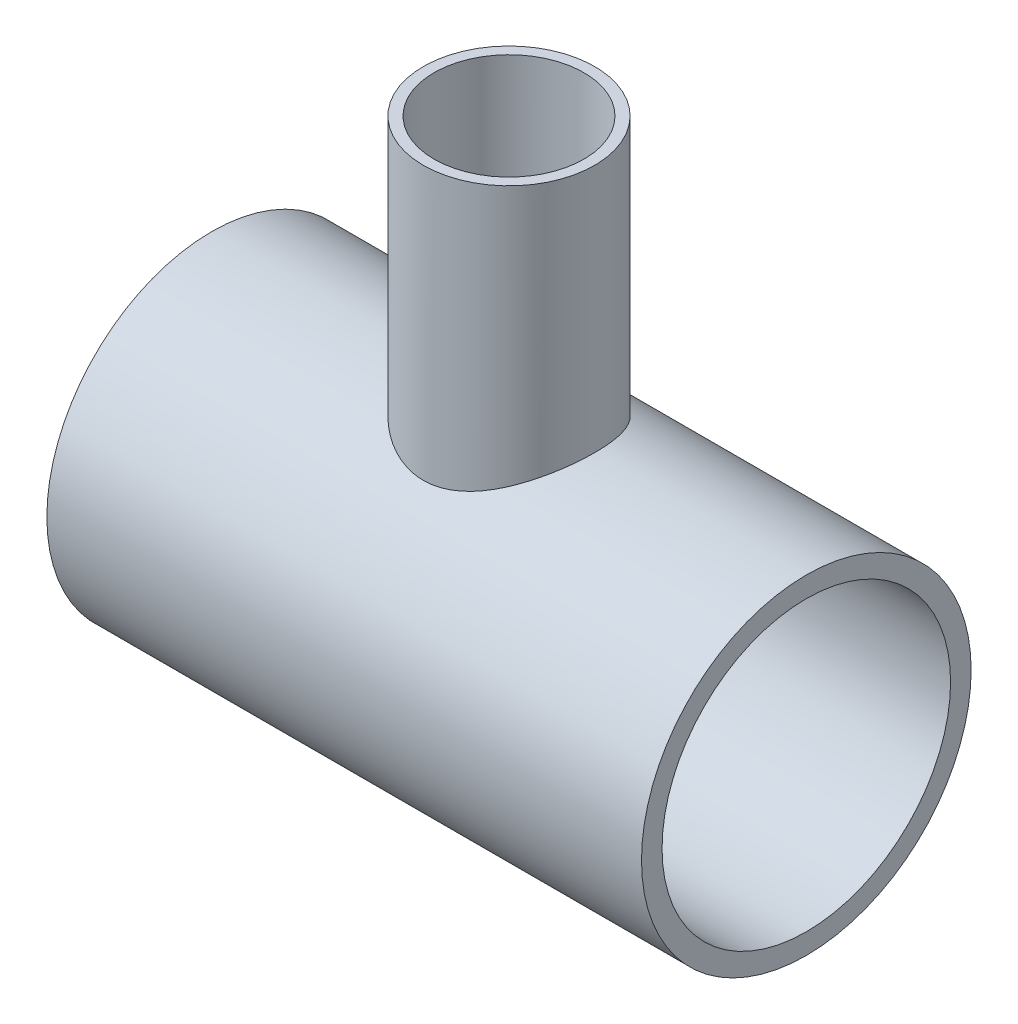
ISO-10303-21;
HEADER;
FILE_DESCRIPTION(('STEP AP214'),'2;1');
FILE_NAME('part.step','',(''),(''),'','','');
FILE_SCHEMA(('AUTOMOTIVE_DESIGN { 1 0 10303 214 1 1 1 1 }'));
ENDSEC;
DATA;
#1=APPLICATION_CONTEXT('core data for automotive mechanical design processes');
#2=APPLICATION_PROTOCOL_DEFINITION('international standard','automotive_design',2000,#1);
#3=PRODUCT_CONTEXT('',#1,'mechanical');
#4=PRODUCT('Part','Part','',(#3));
#5=PRODUCT_RELATED_PRODUCT_CATEGORY('part','',(#4));
#6=PRODUCT_DEFINITION_FORMATION('','',#4);
#7=PRODUCT_DEFINITION_CONTEXT('part definition',#1,'design');
#8=PRODUCT_DEFINITION('design','',#6,#7);
#9=PRODUCT_DEFINITION_SHAPE('','',#8);
#10=(LENGTH_UNIT() NAMED_UNIT(*) SI_UNIT(.MILLI.,.METRE.));
#11=(NAMED_UNIT(*) PLANE_ANGLE_UNIT() SI_UNIT($,.RADIAN.));
#12=(NAMED_UNIT(*) SI_UNIT($,.STERADIAN.) SOLID_ANGLE_UNIT());
#13=UNCERTAINTY_MEASURE_WITH_UNIT(LENGTH_MEASURE(1.E-05),#10,'distance_accuracy_value','');
#14=(GEOMETRIC_REPRESENTATION_CONTEXT(3) GLOBAL_UNCERTAINTY_ASSIGNED_CONTEXT((#13)) GLOBAL_UNIT_ASSIGNED_CONTEXT((#10,
#11,#12)) REPRESENTATION_CONTEXT('',''));
#15=CARTESIAN_POINT('',(0.,0.,0.));
#16=DIRECTION('',(0.,0.,1.));
#17=DIRECTION('',(1.,0.,0.));
#18=AXIS2_PLACEMENT_3D('',#15,#16,#17);
#19=CARTESIAN_POINT('',(-292.1,161.925,0.));
#20=DIRECTION('',(1.,0.,0.));
#21=DIRECTION('',(0.,0.,-1.));
#22=AXIS2_PLACEMENT_3D('',#19,#20,#21);
#23=PLANE('',#22);
#24=CARTESIAN_POINT('',(-292.1,0.,0.));
#25=DIRECTION('',(-1.,0.,0.));
#26=DIRECTION('',(0.,0.,1.));
#27=AXIS2_PLACEMENT_3D('',#24,#25,#26);
#28=CIRCLE('',#27,141.732);
#29=CARTESIAN_POINT('',(-292.1,0.,141.732));
#30=VERTEX_POINT('',#29);
#31=EDGE_CURVE('E10',#30,#30,#28,.T.);
#32=ORIENTED_EDGE('',*,*,#31,.F.);
#33=EDGE_LOOP('',(#32));
#34=FACE_BOUND('',#33,.T.);
#35=CARTESIAN_POINT('',(-292.1,0.,0.));
#36=DIRECTION('',(-1.,0.,0.));
#37=DIRECTION('',(0.,0.,1.));
#38=AXIS2_PLACEMENT_3D('',#35,#36,#37);
#39=CIRCLE('',#38,161.925);
#40=CARTESIAN_POINT('',(-292.1,0.,161.925));
#41=VERTEX_POINT('',#40);
#42=EDGE_CURVE('E52',#41,#41,#39,.T.);
#43=ORIENTED_EDGE('',*,*,#42,.T.);
#44=EDGE_LOOP('',(#43));
#45=FACE_BOUND('',#44,.T.);
#46=ADVANCED_FACE('F38',(#34,#45),#23,.F.);
#47=CARTESIAN_POINT('',(0.,0.,0.));
#48=DIRECTION('',(-1.,0.,0.));
#49=DIRECTION('',(0.,0.,1.));
#50=AXIS2_PLACEMENT_3D('',#47,#48,#49);
#51=CYLINDRICAL_SURFACE('',#50,141.732);
#52=CARTESIAN_POINT('',(0.,121.095148650596,73.6473));
#53=CARTESIAN_POINT('',(0.953807441131773,121.095148834812,73.6472998590983));
#54=CARTESIAN_POINT('',(1.90761916065207,121.106427131064,73.6287649017258));
#55=CARTESIAN_POINT('',(3.81337534801943,121.151431121258,73.5546900482305));
#56=CARTESIAN_POINT('',(4.7653195975043,121.185159299654,73.4991460564409));
#57=CARTESIAN_POINT('',(6.66558030408513,121.274745796661,73.3512326175063));
#58=CARTESIAN_POINT('',(7.61389559545033,121.33061070765,73.2588522003245));
#59=CARTESIAN_POINT('',(9.50483040392671,121.463933890605,73.0375879796479));
#60=CARTESIAN_POINT('',(10.4474492898645,121.541394512172,72.9087002041482));
#61=CARTESIAN_POINT('',(12.3265524266506,121.717305761536,72.6146451297684));
#62=CARTESIAN_POINT('',(13.2630248074926,121.815788958993,72.4494215247036));
#63=CARTESIAN_POINT('',(15.1267327430204,122.032767404578,72.0833458860256));
#64=CARTESIAN_POINT('',(16.0539673000441,122.151264789903,71.8824900473426));
#65=CARTESIAN_POINT('',(17.8973406970957,122.407176940448,71.445831907943));
#66=CARTESIAN_POINT('',(18.8134817059656,122.544587940811,71.2100365614087));
#67=CARTESIAN_POINT('',(20.6334140771599,122.837150771884,70.7041685144363));
#68=CARTESIAN_POINT('',(21.5372041845084,122.992304390638,70.4340923589897));
#69=CARTESIAN_POINT('',(24.2175345675528,123.480573159199,69.5768621385893));
#70=CARTESIAN_POINT('',(25.9740862085565,123.838056884867,68.9400769779369));
#71=CARTESIAN_POINT('',(29.4233675562484,124.607144297281,67.5400362459252));
#72=CARTESIAN_POINT('',(31.1160962043682,125.018748881168,66.7767785780241));
#73=CARTESIAN_POINT('',(34.4304724802344,125.884604570244,65.1298039826774));
#74=CARTESIAN_POINT('',(36.052120902723,126.338855198432,64.2460884025165));
#75=CARTESIAN_POINT('',(39.2179654669398,127.278427353189,62.3639952682743));
#76=CARTESIAN_POINT('',(40.762157849476,127.763750385205,61.3656121567281));
#77=CARTESIAN_POINT('',(43.9020540511952,128.798430594398,59.1652858381241));
#78=CARTESIAN_POINT('',(45.4899952950847,129.349630915087,57.9531209164021));
#79=CARTESIAN_POINT('',(48.5604662590219,130.461126031861,55.4056452670575));
#80=CARTESIAN_POINT('',(50.0429909675051,131.02142125877,54.0703286916552));
#81=CARTESIAN_POINT('',(52.8964735054971,132.137605666543,51.2822500357951));
#82=CARTESIAN_POINT('',(54.2673747247769,132.693492484263,49.8294290979517));
#83=CARTESIAN_POINT('',(56.8898535299258,133.787406456183,46.8130553269121));
#84=CARTESIAN_POINT('',(58.1414271657354,134.325433018776,45.2494988310591));
#85=CARTESIAN_POINT('',(59.9674395625206,135.128830498218,42.7667159516981));
#86=CARTESIAN_POINT('',(60.5872680083997,135.405186611271,41.8840511455615));
#87=CARTESIAN_POINT('',(61.7889611747112,135.947133400804,40.0900772129981));
#88=CARTESIAN_POINT('',(62.3708295044068,136.212725099857,39.178770822069));
#89=CARTESIAN_POINT('',(63.4954456089669,136.731333853161,37.3286143006785));
#90=CARTESIAN_POINT('',(64.0381861388121,136.984348575943,36.3897591142515));
#91=CARTESIAN_POINT('',(65.0830804621645,137.47592467955,34.4861726295281));
#92=CARTESIAN_POINT('',(65.5852390546697,137.71448776851,33.521444408858));
#93=CARTESIAN_POINT('',(66.5475400344737,138.175366007662,31.5679393608836));
#94=CARTESIAN_POINT('',(67.0076987343504,138.397687459282,30.5791720608418));
#95=CARTESIAN_POINT('',(67.884870780324,138.824507570466,28.5790385181722));
#96=CARTESIAN_POINT('',(68.3018890562079,139.02900826604,27.5676748737936));
#97=CARTESIAN_POINT('',(69.0915558800724,139.418650762236,25.5241369027483));
#98=CARTESIAN_POINT('',(69.4642058128544,139.603793167036,24.4919632267699));
#99=CARTESIAN_POINT('',(70.1639281099816,139.953277731939,22.4088193508097));
#100=CARTESIAN_POINT('',(70.4910014208319,140.117620323991,21.3578495416852));
#101=CARTESIAN_POINT('',(71.0754035776143,140.412568301611,19.3196520883119));
#102=CARTESIAN_POINT('',(71.3361403110635,140.544786933992,18.3336336666011));
#103=CARTESIAN_POINT('',(71.8169026529561,140.789416135417,16.3492941121087));
#104=CARTESIAN_POINT('',(72.0369289347847,140.901827032096,15.3509731831124));
#105=CARTESIAN_POINT('',(72.4355459955183,141.106038318023,13.344029459789));
#106=CARTESIAN_POINT('',(72.6141379791617,141.19783930652,12.3354069658795));
#107=CARTESIAN_POINT('',(72.9292881526187,141.360170661375,10.3099082004614));
#108=CARTESIAN_POINT('',(73.0658462419271,141.430700976873,9.29303190922368));
#109=CARTESIAN_POINT('',(73.2963859975414,141.549939938651,7.25375519165352));
#110=CARTESIAN_POINT('',(73.3903909990139,141.598660544728,6.23135810485138));
#111=CARTESIAN_POINT('',(73.5355978163098,141.673975437289,4.18271889695272));
#112=CARTESIAN_POINT('',(73.5867998725363,141.700569848046,3.15647679748426));
#113=CARTESIAN_POINT('',(73.6462146664877,141.731433773791,1.10246895392483));
#114=CARTESIAN_POINT('',(73.6544296746255,141.735704467834,0.0747032931706185));
#115=CARTESIAN_POINT('',(73.6278456492794,141.721891534508,-1.98010733833253));
#116=CARTESIAN_POINT('',(73.5930475183771,141.703808376209,-3.00715232375154));
#117=CARTESIAN_POINT('',(73.485853148075,141.648169026751,-4.96187923033489));
#118=CARTESIAN_POINT('',(73.417296277295,141.612601876174,-5.88983125431735));
#119=CARTESIAN_POINT('',(73.2451759857234,141.523444711221,-7.74169172960341));
#120=CARTESIAN_POINT('',(73.1416098093332,141.469853278147,-8.66559985680974));
#121=CARTESIAN_POINT('',(72.8997932387281,141.344982809151,-10.5075006993611));
#122=CARTESIAN_POINT('',(72.7615486875162,141.273706752955,-11.4254943845386));
#123=CARTESIAN_POINT('',(72.4507467884063,141.113883031421,-13.2542226273771));
#124=CARTESIAN_POINT('',(72.2781861924183,141.025333731147,-14.164956489386));
#125=CARTESIAN_POINT('',(71.899242870827,140.831493680971,-15.9775075478984));
#126=CARTESIAN_POINT('',(71.6928624533553,140.726204073575,-16.8793253484538));
#127=CARTESIAN_POINT('',(71.2468265205092,140.49949672707,-18.6726718568046));
#128=CARTESIAN_POINT('',(71.0071679297142,140.378077497379,-19.5641996053819));
#129=CARTESIAN_POINT('',(70.2391890107711,139.990650175522,-22.2211269251538));
#130=CARTESIAN_POINT('',(69.6617811034016,139.701428939864,-23.969273256017));
#131=CARTESIAN_POINT('',(68.3736334598451,139.063554047005,-27.4303775493643));
#132=CARTESIAN_POINT('',(67.6612856716377,138.714188793218,-29.1426013744962));
#133=CARTESIAN_POINT('',(66.114367352944,137.966250430439,-32.4997042849283));
#134=CARTESIAN_POINT('',(65.2797971246856,137.567677443126,-34.1445835367433));
#135=CARTESIAN_POINT('',(63.4945993739895,136.729579745194,-37.3596400878981));
#136=CARTESIAN_POINT('',(62.5439437071012,136.290045109726,-38.9297991428825));
#137=CARTESIAN_POINT('',(60.5329811156828,135.378999005865,-41.9884915297323));
#138=CARTESIAN_POINT('',(59.472667903372,134.907485704343,-43.4770201734));
#139=CARTESIAN_POINT('',(57.1371753045318,133.893529117168,-46.5111837250457));
#140=CARTESIAN_POINT('',(55.8511125869885,133.348706706947,-48.0476569447557));
#141=CARTESIAN_POINT('',(53.1610808720216,132.244588444829,-51.0080893120744));
#142=CARTESIAN_POINT('',(51.7571049042362,131.685291738649,-52.4320417984252));
#143=CARTESIAN_POINT('',(48.8370854757313,130.565220643002,-55.1621404466109));
#144=CARTESIAN_POINT('',(47.3209507144027,130.004445416128,-56.4681886674447));
#145=CARTESIAN_POINT('',(44.1845350643819,128.895909999696,-58.9547088079694));
#146=CARTESIAN_POINT('',(42.5642504702961,128.348150274147,-60.1351762558354));
#147=CARTESIAN_POINT('',(39.104630623049,127.241233919309,-62.4450588488895));
#148=CARTESIAN_POINT('',(37.2579342943077,126.684144765914,-63.5645202406377));
#149=CARTESIAN_POINT('',(34.411505347312,125.886283135239,-65.1225337346438));
#150=CARTESIAN_POINT('',(33.4497728848507,125.626578354585,-65.621759378017));
#151=CARTESIAN_POINT('',(31.5020858767877,125.122068826907,-66.578676448333));
#152=CARTESIAN_POINT('',(30.5161342872929,124.877262274013,-67.0363729124954));
#153=CARTESIAN_POINT('',(28.5222102670653,124.405040015808,-67.9087013289056));
#154=CARTESIAN_POINT('',(27.5142548914705,124.177611415996,-68.3233652948689));
#155=CARTESIAN_POINT('',(25.4773580232893,123.742236813453,-69.1087566777208));
#156=CARTESIAN_POINT('',(24.448419069347,123.534288470781,-69.4794893729919));
#157=CARTESIAN_POINT('',(22.3713457501157,123.14005248348,-70.1758320846277));
#158=CARTESIAN_POINT('',(21.3232123432171,122.95376376077,-70.5014443469654));
#159=CARTESIAN_POINT('',(19.2097783359276,122.604912404893,-71.1063797863388));
#160=CARTESIAN_POINT('',(18.1444781542842,122.442349193963,-71.3857040906022));
#161=CARTESIAN_POINT('',(16.0855527284308,122.154927554338,-71.8763358201426));
#162=CARTESIAN_POINT('',(15.0930774266831,122.028085458464,-72.0913122759593));
#163=CARTESIAN_POINT('',(13.0975212099845,121.797364317283,-72.480432327439));
#164=CARTESIAN_POINT('',(12.0944406064567,121.693484599642,-72.6545771186561));
#165=CARTESIAN_POINT('',(10.079789188104,121.509797809547,-72.9613654226254));
#166=CARTESIAN_POINT('',(9.06821864046693,121.429989982423,-73.0940102364356));
#167=CARTESIAN_POINT('',(7.03878827309765,121.295319325362,-73.3172718337871));
#168=CARTESIAN_POINT('',(6.02092844138688,121.24045654295,-73.4078885372568));
#169=CARTESIAN_POINT('',(3.98200105199503,121.156322942099,-73.5466642716448));
#170=CARTESIAN_POINT('',(2.96093634783079,121.127033636995,-73.5948539725872));
#171=CARTESIAN_POINT('',(0.91726333804559,121.09431253144,-73.6486815607474));
#172=CARTESIAN_POINT('',(-0.105344976596594,121.090880882696,-73.6543191983102));
#173=CARTESIAN_POINT('',(-2.14959074475858,121.109913587401,-73.6230193641966));
#174=CARTESIAN_POINT('',(-3.17122826304884,121.132376071021,-73.5860849666705));
#175=CARTESIAN_POINT('',(-5.21117706322024,121.202938784037,-73.4698039671252));
#176=CARTESIAN_POINT('',(-6.22948843644301,121.251038303339,-73.3904585398067));
#177=CARTESIAN_POINT('',(-8.13550592698157,121.364867355264,-73.2020441817213));
#178=CARTESIAN_POINT('',(-9.02387055192145,121.427700721698,-73.0978316202783));
#179=CARTESIAN_POINT('',(-10.7947928644372,121.572133694811,-72.857366195883));
#180=CARTESIAN_POINT('',(-11.6773500699473,121.653734839657,-72.7211107067379));
#181=CARTESIAN_POINT('',(-13.4349575637479,121.83500843516,-72.4170000517143));
#182=CARTESIAN_POINT('',(-14.3100093006141,121.934677312577,-72.2491511337882));
#183=CARTESIAN_POINT('',(-16.0514323122231,122.1512855029,-71.8823237508189));
#184=CARTESIAN_POINT('',(-16.9178027758106,122.268226413883,-71.6833424051777));
#185=CARTESIAN_POINT('',(-19.5022315475895,122.64366660548,-71.0404006814231));
#186=CARTESIAN_POINT('',(-21.2055657241922,122.926778994677,-70.550449824722));
#187=CARTESIAN_POINT('',(-24.5628900211693,123.55018067482,-69.4529345917728));
#188=CARTESIAN_POINT('',(-26.2168769630342,123.890473639508,-68.8453626582163));
#189=CARTESIAN_POINT('',(-29.5419057736692,124.635534678918,-67.487552099462));
#190=CARTESIAN_POINT('',(-31.210316660755,125.042527552127,-66.7320912454854));
#191=CARTESIAN_POINT('',(-34.4778095225479,125.897843907492,-65.1040542826059));
#192=CARTESIAN_POINT('',(-36.0768905778605,126.346167937503,-64.2314766212258));
#193=CARTESIAN_POINT('',(-39.2003008137126,127.273223375685,-62.3743828240053));
#194=CARTESIAN_POINT('',(-40.7245995511826,127.751966988276,-61.3898216333069));
#195=CARTESIAN_POINT('',(-43.6924025467978,128.728773711698,-59.3142335844527));
#196=CARTESIAN_POINT('',(-45.1359012993566,129.226838135114,-58.2231994852595));
#197=CARTESIAN_POINT('',(-48.1309010849211,130.30120219205,-55.7814724592548));
#198=CARTESIAN_POINT('',(-49.6697092861298,130.878791262505,-54.4157396884619));
#199=CARTESIAN_POINT('',(-52.6286056417713,132.030100454536,-51.559511913502));
#200=CARTESIAN_POINT('',(-54.0486840088866,132.603820253577,-50.0690066441272));
#201=CARTESIAN_POINT('',(-56.7628110084926,133.733048269162,-46.9697060547426));
#202=CARTESIAN_POINT('',(-58.0568046670205,134.288548472408,-45.3608596687913));
#203=CARTESIAN_POINT('',(-60.5098870263224,135.367158839613,-42.0327259658238));
#204=CARTESIAN_POINT('',(-61.6689763463064,135.890269152236,-40.3134391557846));
#205=CARTESIAN_POINT('',(-63.3184762495591,136.649242819258,-37.6278066316612));
#206=CARTESIAN_POINT('',(-63.8617595969737,136.901957452037,-36.698269379597));
#207=CARTESIAN_POINT('',(-64.9084771793175,137.393346894012,-34.8134451140822));
#208=CARTESIAN_POINT('',(-65.411915662757,137.632023199364,-33.8581608605392));
#209=CARTESIAN_POINT('',(-66.377757208444,138.093670166962,-31.9231534599995));
#210=CARTESIAN_POINT('',(-66.840153200413,138.316638121815,-30.9434261393585));
#211=CARTESIAN_POINT('',(-67.722494198096,138.745171194694,-28.9614410610403));
#212=CARTESIAN_POINT('',(-68.1424443800499,138.950738434228,-27.9591860688649));
#213=CARTESIAN_POINT('',(-68.9384503990677,139.342832853798,-25.9344821695624));
#214=CARTESIAN_POINT('',(-69.3145337880916,139.529371975718,-24.9120464146603));
#215=CARTESIAN_POINT('',(-70.0218701441765,139.882105182286,-22.848457439551));
#216=CARTESIAN_POINT('',(-70.3531284586487,140.04830169348,-21.8073064687939));
#217=CARTESIAN_POINT('',(-70.9697265786516,140.359061731181,-19.7083512193804));
#218=CARTESIAN_POINT('',(-71.2550682904605,140.503626155749,-18.6505476340783));
#219=CARTESIAN_POINT('',(-71.7788175965382,140.76996417718,-16.5205580811134));
#220=CARTESIAN_POINT('',(-72.0172264229447,140.891738372355,-15.4483724918135));
#221=CARTESIAN_POINT('',(-72.4255845733939,141.100930736806,-13.3957725129318));
#222=CARTESIAN_POINT('',(-72.5999126259235,141.190526648039,-12.4164484851673));
#223=CARTESIAN_POINT('',(-72.9089421142242,141.349677419683,-10.4499544101786));
#224=CARTESIAN_POINT('',(-73.0436441980356,141.419232607837,-9.46278449153668));
#225=CARTESIAN_POINT('',(-73.2729721938257,141.537817735858,-7.48262659228661));
#226=CARTESIAN_POINT('',(-73.3676002681077,141.586848783158,-6.48963892852283));
#227=CARTESIAN_POINT('',(-73.5164726132859,141.664048784822,-4.49982525010602));
#228=CARTESIAN_POINT('',(-73.5707167132154,141.692217650865,-3.50299921922111));
#229=CARTESIAN_POINT('',(-73.6386229634145,141.72748843014,-1.50793894651667));
#230=CARTESIAN_POINT('',(-73.6522991764817,141.734597643667,-0.509705312720232));
#231=CARTESIAN_POINT('',(-73.6390624866911,141.727719653415,1.48641845813084));
#232=CARTESIAN_POINT('',(-73.6121496599232,141.713732489182,2.4843085958259));
#233=CARTESIAN_POINT('',(-73.5178292008357,141.664761377957,4.47762429620717));
#234=CARTESIAN_POINT('',(-73.4504227587176,141.629778048089,5.47304993046742));
#235=CARTESIAN_POINT('',(-73.2753457172105,141.539060706622,7.45939200093112));
#236=CARTESIAN_POINT('',(-73.1676757212165,141.483327005991,8.45030850448377));
#237=CARTESIAN_POINT('',(-72.9219904298898,141.356434327024,10.3516643759782));
#238=CARTESIAN_POINT('',(-72.7868502705005,141.286742469942,11.2625749976676));
#239=CARTESIAN_POINT('',(-72.4827876333599,141.130338818636,13.0773406235839));
#240=CARTESIAN_POINT('',(-72.3138624868933,141.043625679893,13.981195064571));
#241=CARTESIAN_POINT('',(-71.9427190214326,140.85369856303,15.780153707665));
#242=CARTESIAN_POINT('',(-71.7405059143411,140.750487168119,16.6752592563826));
#243=CARTESIAN_POINT('',(-71.303305008802,140.528150396634,18.455458723904));
#244=CARTESIAN_POINT('',(-71.0683142120975,140.409023564276,19.3405517188185));
#245=CARTESIAN_POINT('',(-70.3150410381054,140.028750529279,21.9786964324173));
#246=CARTESIAN_POINT('',(-69.7483883123012,139.744675929507,23.7149501036971));
#247=CARTESIAN_POINT('',(-68.4916557300146,139.121689707703,27.1317745941843));
#248=CARTESIAN_POINT('',(-67.8015700294823,138.78277548931,28.8123427724425));
#249=CARTESIAN_POINT('',(-66.2737128294021,138.042658461145,32.1755489647677));
#250=CARTESIAN_POINT('',(-65.4311334963645,137.639504644323,33.8555743600646));
#251=CARTESIAN_POINT('',(-63.6254290062576,136.790334170335,37.1381075009717));
#252=CARTESIAN_POINT('',(-62.6623018950612,136.344316818363,38.7406139893858));
#253=CARTESIAN_POINT('',(-60.6218263827144,135.418661513755,41.8616372487621));
#254=CARTESIAN_POINT('',(-59.544438819394,134.939012053103,43.3801249496022));
#255=CARTESIAN_POINT('',(-57.2818693613099,133.955997922872,46.3266914357073));
#256=CARTESIAN_POINT('',(-56.0966815270945,133.452631947326,47.7547652320927));
#257=CARTESIAN_POINT('',(-54.1772351179403,132.660545680943,49.8979196754098));
#258=CARTESIAN_POINT('',(-53.4780969655132,132.376407331687,50.6464823879195));
#259=CARTESIAN_POINT('',(-52.0496874045593,131.805827841123,52.1133634426487));
#260=CARTESIAN_POINT('',(-51.3204175082836,131.519386815962,52.8316832990515));
#261=CARTESIAN_POINT('',(-49.8327000623511,130.946026717135,54.2372010460506));
#262=CARTESIAN_POINT('',(-49.074253326599,130.659107657017,54.924399803625));
#263=CARTESIAN_POINT('',(-47.528936186375,130.086585175883,56.2669801015363));
#264=CARTESIAN_POINT('',(-46.7420586027221,129.800982107992,56.9223535062118));
#265=CARTESIAN_POINT('',(-44.3389825423156,128.948575691282,58.8403136257973));
#266=CARTESIAN_POINT('',(-42.6813841303124,128.38658155093,60.0537543701152));
#267=CARTESIAN_POINT('',(-39.2639553609221,127.291299328862,62.3417542275663));
#268=CARTESIAN_POINT('',(-37.5041297942758,126.758009904189,63.4163198413007));
#269=CARTESIAN_POINT('',(-34.7539929571321,125.980376936381,64.940351369934));
#270=CARTESIAN_POINT('',(-33.7975665006334,125.71967359751,65.4432609631776));
#271=CARTESIAN_POINT('',(-31.8605574346817,125.212845908056,66.4078290991608));
#272=CARTESIAN_POINT('',(-30.8799803860241,124.966718244972,66.869497026791));
#273=CARTESIAN_POINT('',(-28.895699786332,124.491238226489,67.7505878388198));
#274=CARTESIAN_POINT('',(-27.8919898251494,124.261890596164,68.1699988365642));
#275=CARTESIAN_POINT('',(-25.8632608975249,123.822302949315,68.9652344512355));
#276=CARTESIAN_POINT('',(-24.8382409130628,123.61206384823,69.3410569801905));
#277=CARTESIAN_POINT('',(-22.7717470929322,123.213483970211,70.046848669019));
#278=CARTESIAN_POINT('',(-21.7303293220498,123.025081707347,70.3769471126875));
#279=CARTESIAN_POINT('',(-19.6301946671785,122.671546375981,70.991388254535));
#280=CARTESIAN_POINT('',(-18.5714781786149,122.506412776417,71.2757319969968));
#281=CARTESIAN_POINT('',(-16.4395667891103,122.201399473598,71.7974168458488));
#282=CARTESIAN_POINT('',(-15.3663803857606,122.061505587682,72.034784356364));
#283=CARTESIAN_POINT('',(-13.2075517143609,121.808561666238,72.461684782389));
#284=CARTESIAN_POINT('',(-12.1219115009942,121.695507267536,72.651225473206));
#285=CARTESIAN_POINT('',(-10.1212995035659,121.51400799156,72.9543102964986));
#286=CARTESIAN_POINT('',(-9.20782663857682,121.441276499886,73.0752408953571));
#287=CARTESIAN_POINT('',(-7.37585048093556,121.316130088546,73.2828160829214));
#288=CARTESIAN_POINT('',(-6.45734866289792,121.263709506147,73.3694702281318));
#289=CARTESIAN_POINT('',(-4.61672526514095,121.17963484506,73.5082478771081));
#290=CARTESIAN_POINT('',(-3.69460342950259,121.147982262177,73.5603688936473));
#291=CARTESIAN_POINT('',(-1.84832272065985,121.105736258505,73.6298996668612));
#292=CARTESIAN_POINT('',(-0.924163368619402,121.095148472106,73.6473001365224));
#293=CARTESIAN_POINT('',(0.,121.095148650596,73.6473));
#294=B_SPLINE_CURVE_WITH_KNOTS('',3,(#52,#53,#54,#55,#56,#57,#58,#59,#60,#61,#62,#63,#64,#65,
#66,#67,#68,#69,#70,#71,#72,#73,#74,#75,#76,#77,#78,#79,#80,#81,#82,#83,#84,#85,#86,#87,#88,#89,
#90,#91,#92,#93,#94,#95,#96,#97,#98,#99,#100,#101,#102,#103,#104,#105,#106,#107,#108,#109,#110,
#111,#112,#113,#114,#115,#116,#117,#118,#119,#120,#121,#122,#123,#124,#125,#126,#127,#128,#129,
#130,#131,#132,#133,#134,#135,#136,#137,#138,#139,#140,#141,#142,#143,#144,#145,#146,#147,#148,
#149,#150,#151,#152,#153,#154,#155,#156,#157,#158,#159,#160,#161,#162,#163,#164,#165,#166,#167,
#168,#169,#170,#171,#172,#173,#174,#175,#176,#177,#178,#179,#180,#181,#182,#183,#184,#185,#186,
#187,#188,#189,#190,#191,#192,#193,#194,#195,#196,#197,#198,#199,#200,#201,#202,#203,#204,#205,
#206,#207,#208,#209,#210,#211,#212,#213,#214,#215,#216,#217,#218,#219,#220,#221,#222,#223,#224,
#225,#226,#227,#228,#229,#230,#231,#232,#233,#234,#235,#236,#237,#238,#239,#240,#241,#242,#243,
#244,#245,#246,#247,#248,#249,#250,#251,#252,#253,#254,#255,#256,#257,#258,#259,#260,#261,#262,
#263,#264,#265,#266,#267,#268,#269,#270,#271,#272,#273,#274,#275,#276,#277,#278,#279,#280,#281,
#282,#283,#284,#285,#286,#287,#288,#289,#290,#291,#292,#293),.UNSPECIFIED.,.T.,.F.,(4,2,2,2,2,2,
2,2,2,2,2,2,2,2,2,2,2,2,2,2,2,2,2,2,2,2,2,2,2,2,2,2,2,2,2,2,2,2,2,2,2,2,2,2,2,2,2,2,2,2,2,2,2,2,
2,2,2,2,2,2,2,2,2,2,2,2,2,2,2,2,2,2,2,2,2,2,2,2,2,2,2,2,2,2,2,2,2,2,2,2,2,2,2,2,2,2,2,2,2,2,2,2,
2,2,2,2,2,2,2,2,2,2,2,2,2,2,2,2,2,2,4),(0.,2.86118366779168,5.72268402586543,8.58503718755091,
11.4477018933007,14.3148342541664,17.1822729728466,20.0491417357894,22.9162996673034,
28.6163242695485,34.3164433708778,40.0164987233615,45.7168304508138,51.9274301098859,
58.1383248274083,64.3523500521443,70.5665809062317,73.9058798037564,77.2448607352655,
80.5844583428505,83.9236604482448,87.2615600533502,90.5990778042433,93.9364913589682,
97.2738355941637,100.358125905709,103.44236519592,106.526514797928,109.610671774231,
112.693135412484,115.775581737949,118.85786525864,121.940084102232,124.732737071002,
127.525609901978,130.318012474021,133.110679479096,135.903155969838,138.695890700787,
144.280122697675,149.935644813003,155.591152943761,161.248034962433,166.905241527639,
173.127863643561,179.35085386483,185.578966741928,191.807301322665,198.488523592187,
201.830418796061,205.171908106376,208.510893445528,211.849477194873,215.187894698806,
218.526230891952,221.59528482477,224.664248884231,227.733116719522,230.801990401567,
233.868643801972,236.935315194563,240.001765154978,243.068130185256,245.757334718604,
248.446759732192,251.135653439784,253.824796090613,259.20320809082,264.581965775806,
270.204763194395,275.827635155038,281.452777448378,287.078302564823,293.482222122593,
299.886669058547,306.293896006468,312.701093544097,316.017937030996,319.334426377353,
322.651485941968,325.968140503939,329.282700586778,332.596864909642,335.910891605822,
339.224831286652,342.220077826541,345.215275379658,348.210311298052,351.205359895945,
354.199370143305,357.193374777976,360.187291416199,363.181163188981,365.95090714451,
368.720869971814,371.490399517264,374.260182564829,379.798716095819,385.33751192332,
391.098131514675,396.858844500052,402.621538359996,408.384549918584,411.572683129086,
414.760656527542,417.94854106005,421.137236281795,427.519089292515,433.900643467017,
437.234468661266,440.567533272469,443.901532854981,447.2356920766,450.560222717359,
453.884677469887,457.207258291958,460.529298606508,463.301390093528,466.072708157222,
468.844225801671,471.616484669275),.UNSPECIFIED.);
#295=CARTESIAN_POINT('',(0.,121.095148650596,73.6473));
#296=VERTEX_POINT('',#295);
#297=EDGE_CURVE('E106',#296,#296,#294,.T.);
#298=ORIENTED_EDGE('',*,*,#297,.T.);
#299=EDGE_LOOP('',(#298));
#300=FACE_BOUND('',#299,.T.);
#301=CARTESIAN_POINT('',(292.1,0.,0.));
#302=DIRECTION('',(-1.,0.,0.));
#303=DIRECTION('',(0.,0.,1.));
#304=AXIS2_PLACEMENT_3D('',#301,#302,#303);
#305=CIRCLE('',#304,141.732);
#306=CARTESIAN_POINT('',(292.1,0.,141.732));
#307=VERTEX_POINT('',#306);
#308=EDGE_CURVE('E44',#307,#307,#305,.T.);
#309=ORIENTED_EDGE('',*,*,#308,.F.);
#310=EDGE_LOOP('',(#309));
#311=FACE_BOUND('',#310,.T.);
#312=ORIENTED_EDGE('',*,*,#31,.T.);
#313=EDGE_LOOP('',(#312));
#314=FACE_BOUND('',#313,.T.);
#315=ADVANCED_FACE('F89',(#300,#311,#314),#51,.F.);
#316=CARTESIAN_POINT('',(292.1,161.925,0.));
#317=DIRECTION('',(-1.,0.,0.));
#318=DIRECTION('',(0.,0.,1.));
#319=AXIS2_PLACEMENT_3D('',#316,#317,#318);
#320=PLANE('',#319);
#321=CARTESIAN_POINT('',(292.1,0.,0.));
#322=DIRECTION('',(-1.,0.,0.));
#323=DIRECTION('',(0.,0.,1.));
#324=AXIS2_PLACEMENT_3D('',#321,#322,#323);
#325=CIRCLE('',#324,161.925);
#326=CARTESIAN_POINT('',(292.1,0.,161.925));
#327=VERTEX_POINT('',#326);
#328=EDGE_CURVE('E48',#327,#327,#325,.T.);
#329=ORIENTED_EDGE('',*,*,#328,.F.);
#330=EDGE_LOOP('',(#329));
#331=FACE_BOUND('',#330,.T.);
#332=ORIENTED_EDGE('',*,*,#308,.T.);
#333=EDGE_LOOP('',(#332));
#334=FACE_BOUND('',#333,.T.);
#335=ADVANCED_FACE('F84',(#331,#334),#320,.F.);
#336=CARTESIAN_POINT('',(0.,0.,0.));
#337=DIRECTION('',(-1.,0.,0.));
#338=DIRECTION('',(0.,0.,1.));
#339=AXIS2_PLACEMENT_3D('',#336,#337,#338);
#340=CYLINDRICAL_SURFACE('',#339,161.925);
#341=CARTESIAN_POINT('',(0.,138.34950928265,84.1375));
#342=CARTESIAN_POINT('',(1.08967187216687,138.349509493883,84.1374998384068));
#343=CARTESIAN_POINT('',(2.17934865044386,138.362393848498,84.1163245721413));
#344=CARTESIAN_POINT('',(4.35656900525236,138.413806527536,84.0316977338507));
#345=CARTESIAN_POINT('',(5.4441123322942,138.45233769049,83.968241482262));
#346=CARTESIAN_POINT('',(7.61505453109698,138.554681560023,83.7992577121321));
#347=CARTESIAN_POINT('',(8.69845207092077,138.61850179872,83.6937176592586));
#348=CARTESIAN_POINT('',(10.8587401144443,138.770810614655,83.4409342201258));
#349=CARTESIAN_POINT('',(11.9356298970755,138.85930187607,83.2936862960722));
#350=CARTESIAN_POINT('',(14.0824012048997,139.060263492384,82.9577428269468));
#351=CARTESIAN_POINT('',(15.1522691682779,139.172771058092,82.7689829494584));
#352=CARTESIAN_POINT('',(17.2814526182041,139.420648074337,82.3507594077303));
#353=CARTESIAN_POINT('',(18.3407669649986,139.556019966395,82.1212913964206));
#354=CARTESIAN_POINT('',(20.4467194863061,139.848375096097,81.6224306813658));
#355=CARTESIAN_POINT('',(21.4933601387278,140.005354032496,81.3530459229066));
#356=CARTESIAN_POINT('',(23.572532723888,140.339579173679,80.775116114389));
#357=CARTESIAN_POINT('',(24.6050632229022,140.516827421125,80.4665671171683));
#358=CARTESIAN_POINT('',(27.6671939780229,141.07462825316,79.4872225639799));
#359=CARTESIAN_POINT('',(29.6739583805912,141.483019748391,78.7597256990905));
#360=CARTESIAN_POINT('',(33.6145740685683,142.361630041832,77.1602450728173));
#361=CARTESIAN_POINT('',(35.5484241443635,142.831849865163,76.2882589157196));
#362=CARTESIAN_POINT('',(39.3349176549234,143.821009450819,74.4066671633703));
#363=CARTESIAN_POINT('',(41.187562001353,144.339948665984,73.3970631136242));
#364=CARTESIAN_POINT('',(44.8043649804555,145.413322896144,71.2468587048719));
#365=CARTESIAN_POINT('',(46.5685193186797,145.967759630878,70.1062519970841));
#366=CARTESIAN_POINT('',(50.1556658451915,147.149782939416,67.5924873268612));
#367=CARTESIAN_POINT('',(51.9697902149469,147.779474994173,66.2076522972216));
#368=CARTESIAN_POINT('',(55.4776117072051,149.049248438677,63.2972952731374));
#369=CARTESIAN_POINT('',(57.1713031045059,149.689330320567,61.7717665982369));
#370=CARTESIAN_POINT('',(60.4312262155366,150.964460237198,58.5865348366586));
#371=CARTESIAN_POINT('',(61.9973932584167,151.599505572247,56.926764512616));
#372=CARTESIAN_POINT('',(64.9934058953182,152.849192806815,53.4807196322052));
#373=CARTESIAN_POINT('',(66.4232469770025,153.463834030527,51.6944408918651));
#374=CARTESIAN_POINT('',(68.5093412712146,154.381632535215,48.8580019917102));
#375=CARTESIAN_POINT('',(69.2174502170584,154.697339623382,47.8496111799648));
#376=CARTESIAN_POINT('',(70.5902968799336,155.316455268651,45.8001057269521));
#377=CARTESIAN_POINT('',(71.2550387203329,155.619864993951,44.7589942107753));
#378=CARTESIAN_POINT('',(72.5398295854972,156.212319082809,42.645304733888));
#379=CARTESIAN_POINT('',(73.1598703335602,156.501360782972,41.5727209973525));
#380=CARTESIAN_POINT('',(74.3535840342813,157.062932615578,39.3979922606222));
#381=CARTESIAN_POINT('',(74.9272624694233,157.335464699376,38.29585077631));
#382=CARTESIAN_POINT('',(76.0266184872868,157.861967160186,36.0640944183245));
#383=CARTESIAN_POINT('',(76.5523147078389,158.115944736647,34.9344904297418));
#384=CARTESIAN_POINT('',(77.5544164504859,158.603539134025,32.6494650384374));
#385=CARTESIAN_POINT('',(78.030827598129,158.837158278235,31.4940466006029));
#386=CARTESIAN_POINT('',(78.9329603725174,159.282280940953,29.1594354999728));
#387=CARTESIAN_POINT('',(79.3586835842867,159.493785150975,27.9802435819289));
#388=CARTESIAN_POINT('',(80.1580606950523,159.893031390474,25.6003864957747));
#389=CARTESIAN_POINT('',(80.531715675292,160.080773913374,24.3997217741506));
#390=CARTESIAN_POINT('',(81.1993500978393,160.417719044436,22.0712055803332));
#391=CARTESIAN_POINT('',(81.49722247045,160.568764457269,20.9447354035358));
#392=CARTESIAN_POINT('',(82.0464549134504,160.848225272973,18.6777482737152));
#393=CARTESIAN_POINT('',(82.297816082502,160.97664121038,17.5372316531681));
#394=CARTESIAN_POINT('',(82.7532020181437,161.209928110975,15.2444255493623));
#395=CARTESIAN_POINT('',(82.9572279933938,161.314799675345,14.0921363674894));
#396=CARTESIAN_POINT('',(83.317258922555,161.500243149741,11.7781289159965));
#397=CARTESIAN_POINT('',(83.47326376165,161.580815001669,10.6164106238387));
#398=CARTESIAN_POINT('',(83.7366318911338,161.717029221294,8.28666905151409));
#399=CARTESIAN_POINT('',(83.8440220768595,161.772685373043,7.11864962020266));
#400=CARTESIAN_POINT('',(84.009903795791,161.858721177466,4.7782068611832));
#401=CARTESIAN_POINT('',(84.068395123405,161.889100723865,3.60578351498005));
#402=CARTESIAN_POINT('',(84.1362645608041,161.924355473497,1.25920215021293));
#403=CARTESIAN_POINT('',(84.1456455053325,161.929232148802,0.0850442356849944));
#404=CARTESIAN_POINT('',(84.115266585278,161.913447886682,-2.26244806555919));
#405=CARTESIAN_POINT('',(84.0755077517601,161.892787485082,-3.43578246903772));
#406=CARTESIAN_POINT('',(83.9530369284303,161.829220823332,-5.66893771227912));
#407=CARTESIAN_POINT('',(83.874711064554,161.788586788789,-6.72906714329691));
#408=CARTESIAN_POINT('',(83.6780655790626,161.686728862936,-8.84471415788139));
#409=CARTESIAN_POINT('',(83.5597425243377,161.62550320417,-9.90023133768084));
#410=CARTESIAN_POINT('',(83.2834720588026,161.482845693585,-12.004502684705));
#411=CARTESIAN_POINT('',(83.1255314643162,161.401417317733,-13.0532579835274));
#412=CARTESIAN_POINT('',(82.7704480818115,161.218828334287,-15.1424792021223));
#413=CARTESIAN_POINT('',(82.5733015828925,161.117665858846,-16.1829443275136));
#414=CARTESIAN_POINT('',(82.1403742550823,160.896218753382,-18.253673057883));
#415=CARTESIAN_POINT('',(81.9045960627249,160.775935428335,-19.283937353962));
#416=CARTESIAN_POINT('',(81.3950030485497,160.516930886661,-21.332765554033));
#417=CARTESIAN_POINT('',(81.1211847112411,160.378207965985,-22.3513283671991));
#418=CARTESIAN_POINT('',(80.536238267165,160.083130231045,-24.3750370061552));
#419=CARTESIAN_POINT('',(80.2251125676075,159.926776554422,-25.380183692958));
#420=CARTESIAN_POINT('',(79.5663001471931,159.597310882542,-27.3756695149081));
#421=CARTESIAN_POINT('',(79.2186100706792,159.424197349282,-28.3660072814396));
#422=CARTESIAN_POINT('',(78.1126028498717,158.876525218972,-31.337571628868));
#423=CARTESIAN_POINT('',(77.2986940053913,158.477367488036,-33.2939541279063));
#424=CARTESIAN_POINT('',(75.5313429942371,157.622880984357,-37.1294469237671));
#425=CARTESIAN_POINT('',(74.5779011724425,157.16755235045,-39.0085574115656));
#426=CARTESIAN_POINT('',(72.5384004827309,156.210100152788,-42.6815240709415));
#427=CARTESIAN_POINT('',(71.4523094525079,155.707965247338,-44.4753594195438));
#428=CARTESIAN_POINT('',(69.1548630238683,154.667168786963,-47.9697522592526));
#429=CARTESIAN_POINT('',(67.9435004425555,154.128505138142,-49.6703043930639));
#430=CARTESIAN_POINT('',(65.275303655692,152.970149201204,-53.1366464603331));
#431=CARTESIAN_POINT('',(63.8060361038162,152.347739133339,-54.8919706437622));
#432=CARTESIAN_POINT('',(60.7328001424769,151.086386515989,-58.2740750215848));
#433=CARTESIAN_POINT('',(59.1288237700215,150.447442990716,-59.9008476059082));
#434=CARTESIAN_POINT('',(55.7928401831646,149.167869902307,-63.0198047753881));
#435=CARTESIAN_POINT('',(54.0607286726856,148.527239384272,-64.5118774784048));
#436=CARTESIAN_POINT('',(50.4775249226746,147.260849185489,-67.3525573034027));
#437=CARTESIAN_POINT('',(48.6264284505247,146.635090034841,-68.7011593172064));
#438=CARTESIAN_POINT('',(44.673996719516,145.370559456065,-71.3400263230323));
#439=CARTESIAN_POINT('',(42.5642528061335,144.734149863265,-72.6189207989689));
#440=CARTESIAN_POINT('',(39.3123743289314,143.822688090599,-74.3988230344759));
#441=CARTESIAN_POINT('',(38.2136516432825,143.526006764542,-74.969146773144));
#442=CARTESIAN_POINT('',(35.9885347413947,142.949666442028,-76.062343853399));
#443=CARTESIAN_POINT('',(34.862143902213,142.670005382497,-76.5852229496673));
#444=CARTESIAN_POINT('',(32.584205516561,142.130551016847,-77.5817825211287));
#445=CARTESIAN_POINT('',(31.4326774532624,141.870742980229,-78.0554995687895));
#446=CARTESIAN_POINT('',(29.1056468161653,141.373384196849,-78.9527388128233));
#447=CARTESIAN_POINT('',(27.9301471424751,141.135830776928,-79.3762670393555));
#448=CARTESIAN_POINT('',(25.5572191033337,140.685469382827,-80.1717736164733));
#449=CARTESIAN_POINT('',(24.3597918326351,140.47266017715,-80.543754532698));
#450=CARTESIAN_POINT('',(21.9453257536105,140.074146594327,-81.2348340083381));
#451=CARTESIAN_POINT('',(20.7282874236367,139.888441557164,-81.5539338554908));
#452=CARTESIAN_POINT('',(18.3760948065698,139.560104726465,-82.1144297086175));
#453=CARTESIAN_POINT('',(17.2422541735395,139.415206811294,-82.3600173062152));
#454=CARTESIAN_POINT('',(14.9624574087326,139.151643914187,-82.8045435926284));
#455=CARTESIAN_POINT('',(13.816501632689,139.032978164234,-83.0034836471865));
#456=CARTESIAN_POINT('',(11.5148912771084,138.823147092652,-83.3539512881349));
#457=CARTESIAN_POINT('',(10.3592370028039,138.731980908864,-83.505480360947));
#458=CARTESIAN_POINT('',(8.04074403846271,138.578145443073,-83.7605243222552));
#459=CARTESIAN_POINT('',(6.87790533474024,138.515476215372,-83.8640391192595));
#460=CARTESIAN_POINT('',(4.54856380153871,138.419373652217,-84.0225637673322));
#461=CARTESIAN_POINT('',(3.38206423108217,138.385919201014,-84.0776086515476));
#462=CARTESIAN_POINT('',(1.04730214100533,138.348549489579,-84.1390859377284));
#463=CARTESIAN_POINT('',(-0.120960388916794,138.344634402634,-84.1455180545173));
#464=CARTESIAN_POINT('',(-2.45637577697059,138.366387309026,-84.109743269732));
#465=CARTESIAN_POINT('',(-3.6235287091265,138.392053166614,-84.0675398796487));
#466=CARTESIAN_POINT('',(-5.95403453109123,138.472672995149,-83.934680068135));
#467=CARTESIAN_POINT('',(-7.11738752524023,138.527626154994,-83.8440249885557));
#468=CARTESIAN_POINT('',(-9.29489726024812,138.657672439109,-83.628758033965));
#469=CARTESIAN_POINT('',(-10.3098064092469,138.729457363508,-83.5096936933911));
#470=CARTESIAN_POINT('',(-12.3329940167981,138.894466832773,-83.2349590360665));
#471=CARTESIAN_POINT('',(-13.3412719248908,138.98769313495,-83.0792857188627));
#472=CARTESIAN_POINT('',(-15.3492373769809,139.194786901259,-82.73184268039));
#473=CARTESIAN_POINT('',(-16.348926578608,139.308650284212,-82.5400800958303));
#474=CARTESIAN_POINT('',(-18.3384394860025,139.556120239934,-82.1209725563263));
#475=CARTESIAN_POINT('',(-19.3282622698378,139.689728639583,-81.8936243087532));
#476=CARTESIAN_POINT('',(-21.2966742203893,139.975664893189,-81.403926683802));
#477=CARTESIAN_POINT('',(-22.2752613774314,140.127996040689,-81.1415711475485));
#478=CARTESIAN_POINT('',(-24.2196952795692,140.450206728972,-80.582560108505));
#479=CARTESIAN_POINT('',(-25.1855409073018,140.620087797403,-80.2859016195166));
#480=CARTESIAN_POINT('',(-28.0619745335003,141.154219249277,-79.3455280004362));
#481=CARTESIAN_POINT('',(-29.9518054838127,141.543008877812,-78.6513283401566));
#482=CARTESIAN_POINT('',(-33.7506558100081,142.394208643127,-77.1000134810882));
#483=CARTESIAN_POINT('',(-35.6566553479515,142.859158723766,-76.2369355611904));
#484=CARTESIAN_POINT('',(-39.3895361900201,143.836285501202,-74.3769574256277));
#485=CARTESIAN_POINT('',(-41.2164164447814,144.348462824093,-73.3800554357646));
#486=CARTESIAN_POINT('',(-44.7847513495946,145.407551325697,-71.2583722518179));
#487=CARTESIAN_POINT('',(-46.5261712088941,145.954476445641,-70.1335395855677));
#488=CARTESIAN_POINT('',(-49.9167114827278,147.070397066538,-67.7622399118352));
#489=CARTESIAN_POINT('',(-51.565825608007,147.639394066898,-66.5157646320644));
#490=CARTESIAN_POINT('',(-54.9874190843228,148.86675762742,-63.7261763688674));
#491=CARTESIAN_POINT('',(-56.7453980430384,149.526596893202,-62.1658823931604));
#492=CARTESIAN_POINT('',(-60.125723647109,150.84185344747,-58.9027615239191));
#493=CARTESIAN_POINT('',(-61.7480591114727,151.497270367341,-57.1999229036434));
#494=CARTESIAN_POINT('',(-64.8487457471482,152.787296896561,-53.6591075178866));
#495=CARTESIAN_POINT('',(-66.3270341228716,153.421897351964,-51.8210724224285));
#496=CARTESIAN_POINT('',(-69.1294872856447,154.654093382625,-48.0188315885885));
#497=CARTESIAN_POINT('',(-70.4536527808265,155.251689127899,-46.0546264299711));
#498=CARTESIAN_POINT('',(-72.3380634936122,156.118728242622,-42.9864263409849));
#499=CARTESIAN_POINT('',(-72.9587140449226,156.40742357274,-41.9244823132765));
#500=CARTESIAN_POINT('',(-74.1544898217246,156.968774672993,-39.7711777501853));
#501=CARTESIAN_POINT('',(-74.7296199009226,157.241432152395,-38.6798203677368));
#502=CARTESIAN_POINT('',(-75.8329994835549,157.768804555746,-36.4691867393688));
#503=CARTESIAN_POINT('',(-76.3612409099762,158.023516386834,-35.3499057257162));
#504=CARTESIAN_POINT('',(-77.3692260586826,158.513058671095,-33.0856051633033));
#505=CARTESIAN_POINT('',(-77.8489756944336,158.747891547893,-31.940588773782));
#506=CARTESIAN_POINT('',(-78.7583284057287,159.195805625787,-29.6274867857324));
#507=CARTESIAN_POINT('',(-79.1879629558076,159.408900468681,-28.4594162111933));
#508=CARTESIAN_POINT('',(-79.9960161326897,159.811847718916,-26.1018926677607));
#509=CARTESIAN_POINT('',(-80.3744408684813,160.001702898334,-24.9124422685488));
#510=CARTESIAN_POINT('',(-81.0788314290329,160.356699536536,-22.5145172528562));
#511=CARTESIAN_POINT('',(-81.4047994312623,160.52184202112,-21.3060434283216));
#512=CARTESIAN_POINT('',(-82.0031163417114,160.826090619296,-18.8726659553585));
#513=CARTESIAN_POINT('',(-82.2754666574848,160.965197416364,-17.6477627391309));
#514=CARTESIAN_POINT('',(-82.7419593024307,161.204163824843,-15.3027959753835));
#515=CARTESIAN_POINT('',(-82.9411038642554,161.306511212096,-14.1839779540669));
#516=CARTESIAN_POINT('',(-83.294122028206,161.488310931194,-11.9373791600759));
#517=CARTESIAN_POINT('',(-83.4479963706173,161.567763637425,-10.809598534273));
#518=CARTESIAN_POINT('',(-83.709960569194,161.703220899222,-8.54739133274841));
#519=CARTESIAN_POINT('',(-83.8180528956458,161.759226719924,-7.41296511895593));
#520=CARTESIAN_POINT('',(-83.9881016701286,161.847405451224,-5.13972841061701));
#521=CARTESIAN_POINT('',(-84.050057922844,161.879578260926,-4.00091789753032));
#522=CARTESIAN_POINT('',(-84.1276082455097,161.919856996551,-1.72168879766226));
#523=CARTESIAN_POINT('',(-84.1432183793323,161.927971261324,-0.581270905159294));
#524=CARTESIAN_POINT('',(-84.1280683058094,161.920099286693,1.69917176253669));
#525=CARTESIAN_POINT('',(-84.0973081853648,161.904113092454,2.83919653846243));
#526=CARTESIAN_POINT('',(-83.9895254328136,161.848154097733,5.11642972321593));
#527=CARTESIAN_POINT('',(-83.9125041601945,161.80818200213,6.25363821382045));
#528=CARTESIAN_POINT('',(-83.7124624831506,161.704532303171,8.52290342549694));
#529=CARTESIAN_POINT('',(-83.5894427679803,161.64085505502,9.65496022350615));
#530=CARTESIAN_POINT('',(-83.3087364081767,161.495879150036,11.8271405629431));
#531=CARTESIAN_POINT('',(-83.1543340634117,161.416256341591,12.8678025559177));
#532=CARTESIAN_POINT('',(-82.80693332291,161.237566117516,14.9410692753907));
#533=CARTESIAN_POINT('',(-82.6139318781641,161.138497165815,15.9736733586818));
#534=CARTESIAN_POINT('',(-82.1898990384837,160.921512086812,18.0288697847813));
#535=CARTESIAN_POINT('',(-81.9588735967531,160.80359890993,19.0514636683198));
#536=CARTESIAN_POINT('',(-81.4593580108749,160.549579535168,21.0852676790783));
#537=CARTESIAN_POINT('',(-81.1908644394373,160.41347167303,22.0964767557511));
#538=CARTESIAN_POINT('',(-80.6171069758412,160.123837370429,24.1058609773553));
#539=CARTESIAN_POINT('',(-80.3118441811401,159.970311449853,25.104036510316));
#540=CARTESIAN_POINT('',(-79.6652807355077,159.646689618027,27.085954182094));
#541=CARTESIAN_POINT('',(-79.3239769444418,159.476592263062,28.0696950547478));
#542=CARTESIAN_POINT('',(-78.2471839038614,158.942815435527,30.9970766977193));
#543=CARTESIAN_POINT('',(-77.4586997554434,158.555593641221,32.9172720913617));
#544=CARTESIAN_POINT('',(-75.7130962869209,157.710030634126,36.7597221277886));
#545=CARTESIAN_POINT('',(-74.7504876891247,157.249462128866,38.6789790012658));
#546=CARTESIAN_POINT('',(-72.6875260641767,156.279347989956,42.4290213777025));
#547=CARTESIAN_POINT('',(-71.5871708037893,155.769801562276,44.2598054456182));
#548=CARTESIAN_POINT('',(-69.255975142396,154.712305224709,47.825393507031));
#549=CARTESIAN_POINT('',(-68.025090000299,154.164342168895,49.5601642784175));
#550=CARTESIAN_POINT('',(-65.440167979585,153.041325035742,52.9264228308169));
#551=CARTESIAN_POINT('',(-64.0861243155878,152.466269466592,54.5579049127632));
#552=CARTESIAN_POINT('',(-61.8932167105909,151.561377901009,57.0063119460758));
#553=CARTESIAN_POINT('',(-61.0944760431616,151.236775318829,57.8614901673599));
#554=CARTESIAN_POINT('',(-59.4625692322882,150.584940335552,59.5372937253108));
#555=CARTESIAN_POINT('',(-58.629404816596,150.257708067104,60.3579207919603));
#556=CARTESIAN_POINT('',(-56.9297423240832,149.602698393772,61.9636191636966));
#557=CARTESIAN_POINT('',(-56.0632451771795,149.27492100434,62.7486914593624));
#558=CARTESIAN_POINT('',(-54.2977786126256,148.620870249784,64.2824860256951));
#559=CARTESIAN_POINT('',(-53.3988009929491,148.29459728835,65.031199001365));
#560=CARTESIAN_POINT('',(-50.6533795340947,147.320809869508,67.2223164997606));
#561=CARTESIAN_POINT('',(-48.7596389422847,146.678791109791,68.6085734645088));
#562=CARTESIAN_POINT('',(-44.8553649753526,145.427552254247,71.2224197615196));
#563=CARTESIAN_POINT('',(-42.8448370744158,144.81833062369,72.4500165219957));
#564=CARTESIAN_POINT('',(-39.7029334238366,143.929982269173,74.1910762323649));
#565=CARTESIAN_POINT('',(-38.6102686484861,143.632164105235,74.7655973124206));
#566=CARTESIAN_POINT('',(-36.3973433464224,143.053183849633,75.8675124876691));
#567=CARTESIAN_POINT('',(-35.2770891724224,142.772017973468,76.3949173047558));
#568=CARTESIAN_POINT('',(-33.0101614763008,142.228851281652,77.4014643952401));
#569=CARTESIAN_POINT('',(-31.8634806313599,141.966855864172,77.8805930888688));
#570=CARTESIAN_POINT('',(-29.545776067017,141.46469439667,78.789055588687));
#571=CARTESIAN_POINT('',(-28.3747511846441,141.224529392494,79.2183870094696));
#572=CARTESIAN_POINT('',(-26.0139054140442,140.769216690636,80.0246651827667));
#573=CARTESIAN_POINT('',(-24.8241485733059,140.553998748262,80.4017596367362));
#574=CARTESIAN_POINT('',(-22.4248732277979,140.150146102112,81.103675453984));
#575=CARTESIAN_POINT('',(-21.2153551747056,139.961510791689,81.4284980101927));
#576=CARTESIAN_POINT('',(-18.7797799612827,139.613090538699,82.0244456492867));
#577=CARTESIAN_POINT('',(-17.5537325083644,139.453289393146,82.2956008981752));
#578=CARTESIAN_POINT('',(-15.0874091252728,139.164353626916,82.7832635816331));
#579=CARTESIAN_POINT('',(-13.8471355422996,139.035214021503,82.9997798993729));
#580=CARTESIAN_POINT('',(-11.5616765608833,138.827904253636,83.345978662109));
#581=CARTESIAN_POINT('',(-10.5182041649286,138.744834722238,83.4841036915924));
#582=CARTESIAN_POINT('',(-8.42551450634676,138.601900163829,83.7211927198425));
#583=CARTESIAN_POINT('',(-7.3762989277648,138.542028669219,83.8201676338008));
#584=CARTESIAN_POINT('',(-5.27373385835826,138.44600393234,83.9786771045284));
#585=CARTESIAN_POINT('',(-4.22038407521821,138.409852398767,84.0382088199602));
#586=CARTESIAN_POINT('',(-2.11135809421408,138.361601753999,84.1176256496746));
#587=CARTESIAN_POINT('',(-1.05568134951094,138.349509078006,84.1375001565526));
#588=CARTESIAN_POINT('',(0.,138.34950928265,84.1375));
#589=B_SPLINE_CURVE_WITH_KNOTS('',3,(#341,#342,#343,#344,#345,#346,#347,#348,#349,#350,#351,
#352,#353,#354,#355,#356,#357,#358,#359,#360,#361,#362,#363,#364,#365,#366,#367,#368,#369,#370,
#371,#372,#373,#374,#375,#376,#377,#378,#379,#380,#381,#382,#383,#384,#385,#386,#387,#388,#389,
#390,#391,#392,#393,#394,#395,#396,#397,#398,#399,#400,#401,#402,#403,#404,#405,#406,#407,#408,
#409,#410,#411,#412,#413,#414,#415,#416,#417,#418,#419,#420,#421,#422,#423,#424,#425,#426,#427,
#428,#429,#430,#431,#432,#433,#434,#435,#436,#437,#438,#439,#440,#441,#442,#443,#444,#445,#446,
#447,#448,#449,#450,#451,#452,#453,#454,#455,#456,#457,#458,#459,#460,#461,#462,#463,#464,#465,
#466,#467,#468,#469,#470,#471,#472,#473,#474,#475,#476,#477,#478,#479,#480,#481,#482,#483,#484,
#485,#486,#487,#488,#489,#490,#491,#492,#493,#494,#495,#496,#497,#498,#499,#500,#501,#502,#503,
#504,#505,#506,#507,#508,#509,#510,#511,#512,#513,#514,#515,#516,#517,#518,#519,#520,#521,#522,
#523,#524,#525,#526,#527,#528,#529,#530,#531,#532,#533,#534,#535,#536,#537,#538,#539,#540,#541,
#542,#543,#544,#545,#546,#547,#548,#549,#550,#551,#552,#553,#554,#555,#556,#557,#558,#559,#560,
#561,#562,#563,#564,#565,#566,#567,#568,#569,#570,#571,#572,#573,#574,#575,#576,#577,#578,#579,
#580,#581,#582,#583,#584,#585,#586,#587,#588),.UNSPECIFIED.,.T.,.F.,(4,2,2,2,2,2,2,2,2,2,2,2,2,
2,2,2,2,2,2,2,2,2,2,2,2,2,2,2,2,2,2,2,2,2,2,2,2,2,2,2,2,2,2,2,2,2,2,2,2,2,2,2,2,2,2,2,2,2,2,2,2,
2,2,2,2,2,2,2,2,2,2,2,2,2,2,2,2,2,2,2,2,2,2,2,2,2,2,2,2,2,2,2,2,2,2,2,2,2,2,2,2,2,2,2,2,2,2,2,2,
2,2,2,2,2,2,2,2,2,2,2,2,2,2,4),(0.,3.26874300080318,6.53784783879121,9.80792708233038,
13.0783622455051,16.353901878347,19.6297915046386,22.9050299505351,26.1805987533638,
32.6925624149429,39.2046340593651,45.7166325765729,52.228946818019,59.3241762593814,
66.4197427720731,73.5188855021721,80.6182631296594,84.4331869897345,88.2477475945519,
92.0630126860443,95.8778259486881,99.691151052718,103.504040410832,107.316810507644,
111.129501417082,114.65312220431,118.176659747902,121.700107311357,125.223563299131,
128.74506759765,132.266586702009,135.787902535454,139.309144484894,142.49958380628,
145.69029704468,148.880461686807,152.070928426879,155.261177514773,158.4517216268,
161.642059983697,164.832691386447,171.293816680202,177.754926004473,184.21760501963,
190.680654801479,197.789633423363,204.899032571802,212.014283499291,219.129787675787,
226.762635481896,230.580526318424,234.397953452489,238.212520069207,242.026627902155,
245.840545829141,249.654370867574,253.16056190661,256.666650278877,260.172628717788,
263.678613837347,267.182062811428,270.685532337728,274.188748928832,277.691868504703,
280.764146224438,283.836675834294,286.908598483831,289.980805536859,293.053553801446,
296.126569761753,302.271523337986,308.6952863308,315.119134496293,321.545576464737,
327.972455767389,335.28854662243,342.605239944016,349.925108752201,357.244943927238,
361.034209823248,364.823071135789,368.612583853962,372.401633890534,376.188291271836,
379.974496531261,383.760544585438,387.546493236291,390.9683694182,394.390189640461,
397.811825206077,401.233475256991,404.653939202765,408.074396738367,411.494753761084,
414.915059534202,418.079338701532,421.243867919505,424.407902155376,427.57222600217,
430.736455426241,433.90096076714,440.228728519413,446.809933545519,453.39124528408,
459.974820203187,466.558758062244,470.201016060772,473.843091473357,477.485065352863,
481.127965427586,488.418863077169,495.709419254992,499.518082195669,503.325876207985,
507.134738355843,510.943782881892,514.74182723916,518.539784906532,522.335601668561,
526.130800910423,529.297389604098,532.463094818245,535.629028052928,538.795807989562),.UNSPECIFIED.);
#590=CARTESIAN_POINT('',(0.,138.34950928265,84.1375));
#591=VERTEX_POINT('',#590);
#592=EDGE_CURVE('E57',#591,#591,#589,.T.);
#593=ORIENTED_EDGE('',*,*,#592,.F.);
#594=EDGE_LOOP('',(#593));
#595=FACE_BOUND('',#594,.T.);
#596=ORIENTED_EDGE('',*,*,#42,.F.);
#597=EDGE_LOOP('',(#596));
#598=FACE_BOUND('',#597,.T.);
#599=ORIENTED_EDGE('',*,*,#328,.T.);
#600=EDGE_LOOP('',(#599));
#601=FACE_BOUND('',#600,.T.);
#602=ADVANCED_FACE('F77',(#595,#598,#601),#340,.T.);
#603=CARTESIAN_POINT('',(0.,406.4,0.));
#604=DIRECTION('',(0.,1.,0.));
#605=DIRECTION('',(0.,0.,1.));
#606=AXIS2_PLACEMENT_3D('',#603,#604,#605);
#607=PLANE('',#606);
#608=CARTESIAN_POINT('',(0.,406.4,0.));
#609=DIRECTION('',(0.,1.,0.));
#610=DIRECTION('',(0.,0.,1.));
#611=AXIS2_PLACEMENT_3D('',#608,#609,#610);
#612=CIRCLE('',#611,73.6473);
#613=CARTESIAN_POINT('',(0.,406.4,73.6473));
#614=VERTEX_POINT('',#613);
#615=EDGE_CURVE('E112',#614,#614,#612,.T.);
#616=ORIENTED_EDGE('',*,*,#615,.F.);
#617=EDGE_LOOP('',(#616));
#618=FACE_BOUND('',#617,.T.);
#619=CARTESIAN_POINT('',(0.,406.4,0.));
#620=DIRECTION('',(0.,1.,0.));
#621=DIRECTION('',(0.,0.,1.));
#622=AXIS2_PLACEMENT_3D('',#619,#620,#621);
#623=CIRCLE('',#622,84.1375);
#624=CARTESIAN_POINT('',(0.,406.4,84.1375));
#625=VERTEX_POINT('',#624);
#626=EDGE_CURVE('E65',#625,#625,#623,.T.);
#627=ORIENTED_EDGE('',*,*,#626,.T.);
#628=EDGE_LOOP('',(#627));
#629=FACE_BOUND('',#628,.T.);
#630=ADVANCED_FACE('F75',(#618,#629),#607,.T.);
#631=CARTESIAN_POINT('',(0.,-161.926,0.));
#632=DIRECTION('',(0.,1.,0.));
#633=DIRECTION('',(0.,0.,1.));
#634=AXIS2_PLACEMENT_3D('',#631,#632,#633);
#635=CYLINDRICAL_SURFACE('',#634,84.1375);
#636=ORIENTED_EDGE('',*,*,#626,.F.);
#637=EDGE_LOOP('',(#636));
#638=FACE_BOUND('',#637,.T.);
#639=ORIENTED_EDGE('',*,*,#592,.T.);
#640=EDGE_LOOP('',(#639));
#641=FACE_BOUND('',#640,.T.);
#642=ADVANCED_FACE('F67',(#638,#641),#635,.T.);
#643=CARTESIAN_POINT('',(0.,-208.30602098432,0.));
#644=DIRECTION('',(0.,1.,0.));
#645=DIRECTION('',(0.,0.,1.));
#646=AXIS2_PLACEMENT_3D('',#643,#644,#645);
#647=CYLINDRICAL_SURFACE('',#646,73.6473);
#648=ORIENTED_EDGE('',*,*,#615,.T.);
#649=EDGE_LOOP('',(#648));
#650=FACE_BOUND('',#649,.T.);
#651=ORIENTED_EDGE('',*,*,#297,.F.);
#652=EDGE_LOOP('',(#651));
#653=FACE_BOUND('',#652,.T.);
#654=ADVANCED_FACE('F73',(#650,#653),#647,.F.);
#655=CLOSED_SHELL('',(#46,#315,#335,#602,#630,#642,#654));
#656=MANIFOLD_SOLID_BREP('B2',#655);
#657=ADVANCED_BREP_SHAPE_REPRESENTATION('',(#18,#656),#14);
#658=SHAPE_DEFINITION_REPRESENTATION(#9,#657);
ENDSEC;
END-ISO-10303-21;
